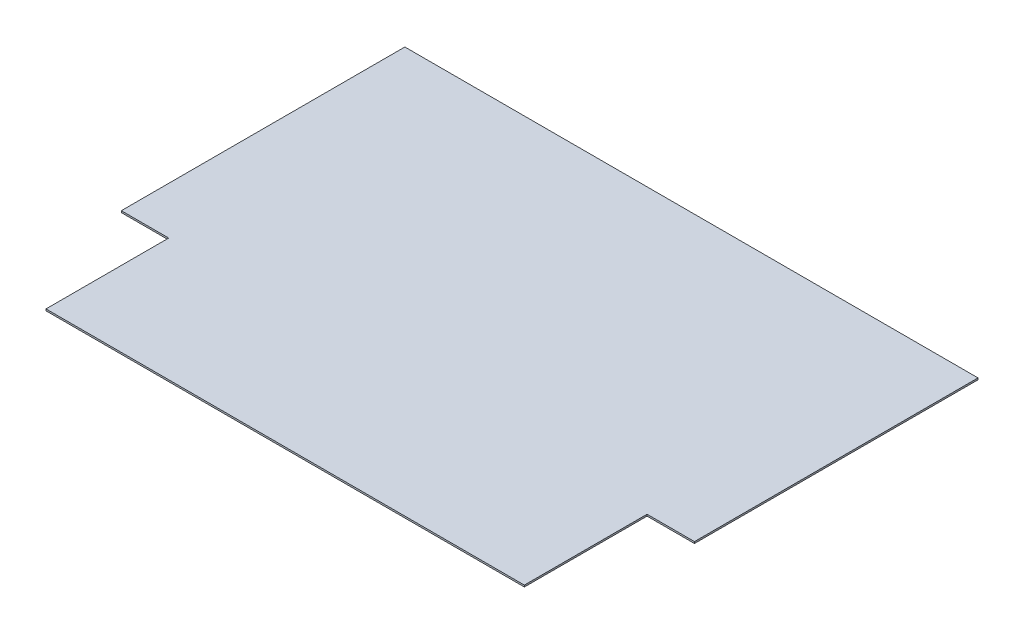
ISO-10303-21;
HEADER;
FILE_DESCRIPTION(('STEP AP214'),'2;1');
FILE_NAME('part.step','',(''),(''),'','','');
FILE_SCHEMA(('AUTOMOTIVE_DESIGN { 1 0 10303 214 1 1 1 1 }'));
ENDSEC;
DATA;
#1=APPLICATION_CONTEXT('core data for automotive mechanical design processes');
#2=APPLICATION_PROTOCOL_DEFINITION('international standard','automotive_design',2000,#1);
#3=PRODUCT_CONTEXT('',#1,'mechanical');
#4=PRODUCT('Part','Part','',(#3));
#5=PRODUCT_RELATED_PRODUCT_CATEGORY('part','',(#4));
#6=PRODUCT_DEFINITION_FORMATION('','',#4);
#7=PRODUCT_DEFINITION_CONTEXT('part definition',#1,'design');
#8=PRODUCT_DEFINITION('design','',#6,#7);
#9=PRODUCT_DEFINITION_SHAPE('','',#8);
#10=(LENGTH_UNIT() NAMED_UNIT(*) SI_UNIT(.MILLI.,.METRE.));
#11=(NAMED_UNIT(*) PLANE_ANGLE_UNIT() SI_UNIT($,.RADIAN.));
#12=(NAMED_UNIT(*) SI_UNIT($,.STERADIAN.) SOLID_ANGLE_UNIT());
#13=UNCERTAINTY_MEASURE_WITH_UNIT(LENGTH_MEASURE(1.E-05),#10,'distance_accuracy_value','');
#14=(GEOMETRIC_REPRESENTATION_CONTEXT(3) GLOBAL_UNCERTAINTY_ASSIGNED_CONTEXT((#13)) GLOBAL_UNIT_ASSIGNED_CONTEXT((#10,
#11,#12)) REPRESENTATION_CONTEXT('',''));
#15=CARTESIAN_POINT('',(0.,0.,0.));
#16=DIRECTION('',(0.,0.,1.));
#17=DIRECTION('',(1.,0.,0.));
#18=AXIS2_PLACEMENT_3D('',#15,#16,#17);
#19=CARTESIAN_POINT('',(-914.400000000001,6.35,0.));
#20=DIRECTION('',(0.,0.,-1.));
#21=DIRECTION('',(-1.,0.,0.));
#22=AXIS2_PLACEMENT_3D('',#19,#20,#21);
#23=PLANE('',#22);
#24=DIRECTION('',(1.,0.,0.));
#25=VECTOR('',#24,1.);
#26=CARTESIAN_POINT('',(-914.400000000001,0.,0.));
#27=LINE('',#26,#25);
#28=CARTESIAN_POINT('',(-1261.09951455284,0.,0.));
#29=VERTEX_POINT('',#28);
#30=CARTESIAN_POINT('',(533.400000000001,0.,0.));
#31=VERTEX_POINT('',#30);
#32=EDGE_CURVE('E113',#29,#31,#27,.T.);
#33=ORIENTED_EDGE('',*,*,#32,.T.);
#34=DIRECTION('',(0.,1.,0.));
#35=VECTOR('',#34,1.);
#36=CARTESIAN_POINT('',(533.400000000001,0.,0.));
#37=LINE('',#36,#35);
#38=CARTESIAN_POINT('',(533.400000000001,6.35,0.));
#39=VERTEX_POINT('',#38);
#40=EDGE_CURVE('E117',#31,#39,#37,.T.);
#41=ORIENTED_EDGE('',*,*,#40,.T.);
#42=DIRECTION('',(1.,0.,0.));
#43=VECTOR('',#42,1.);
#44=CARTESIAN_POINT('',(-914.400000000001,6.35,0.));
#45=LINE('',#44,#43);
#46=CARTESIAN_POINT('',(-1261.09951455284,6.35,0.));
#47=VERTEX_POINT('',#46);
#48=EDGE_CURVE('E42',#47,#39,#45,.T.);
#49=ORIENTED_EDGE('',*,*,#48,.F.);
#50=DIRECTION('',(0.,1.,0.));
#51=VECTOR('',#50,1.);
#52=CARTESIAN_POINT('',(-1261.09951455284,0.,0.));
#53=LINE('',#52,#51);
#54=EDGE_CURVE('E129',#29,#47,#53,.T.);
#55=ORIENTED_EDGE('',*,*,#54,.F.);
#56=EDGE_LOOP('',(#33,#41,#49,#55));
#57=FACE_BOUND('',#56,.T.);
#58=ADVANCED_FACE('F34',(#57),#23,.F.);
#59=CARTESIAN_POINT('',(-1438.89951455284,6.35,0.));
#60=DIRECTION('',(1.,0.,0.));
#61=DIRECTION('',(0.,0.,-1.));
#62=AXIS2_PLACEMENT_3D('',#59,#60,#61);
#63=PLANE('',#62);
#64=DIRECTION('',(0.,0.,1.));
#65=VECTOR('',#64,1.);
#66=CARTESIAN_POINT('',(-1438.89951455284,6.35,0.));
#67=LINE('',#66,#65);
#68=CARTESIAN_POINT('',(-1438.89951455284,6.35,-1524.));
#69=VERTEX_POINT('',#68);
#70=CARTESIAN_POINT('',(-1438.89951455284,6.35,-460.375));
#71=VERTEX_POINT('',#70);
#72=EDGE_CURVE('E11',#69,#71,#67,.T.);
#73=ORIENTED_EDGE('',*,*,#72,.F.);
#74=DIRECTION('',(0.,1.,0.));
#75=VECTOR('',#74,1.);
#76=CARTESIAN_POINT('',(-1438.89951455284,0.,-1524.));
#77=LINE('',#76,#75);
#78=CARTESIAN_POINT('',(-1438.89951455284,0.,-1524.));
#79=VERTEX_POINT('',#78);
#80=EDGE_CURVE('E100',#79,#69,#77,.T.);
#81=ORIENTED_EDGE('',*,*,#80,.F.);
#82=DIRECTION('',(0.,0.,1.));
#83=VECTOR('',#82,1.);
#84=CARTESIAN_POINT('',(-1438.89951455284,0.,0.));
#85=LINE('',#84,#83);
#86=CARTESIAN_POINT('',(-1438.89951455284,0.,-460.375));
#87=VERTEX_POINT('',#86);
#88=EDGE_CURVE('E37',#79,#87,#85,.T.);
#89=ORIENTED_EDGE('',*,*,#88,.T.);
#90=DIRECTION('',(0.,1.,0.));
#91=VECTOR('',#90,1.);
#92=CARTESIAN_POINT('',(-1438.89951455284,0.,-460.375));
#93=LINE('',#92,#91);
#94=EDGE_CURVE('E127',#87,#71,#93,.T.);
#95=ORIENTED_EDGE('',*,*,#94,.T.);
#96=EDGE_LOOP('',(#73,#81,#89,#95));
#97=FACE_BOUND('',#96,.T.);
#98=ADVANCED_FACE('F106',(#97),#63,.F.);
#99=CARTESIAN_POINT('',(0.,6.35,0.));
#100=DIRECTION('',(0.,-1.,0.));
#101=DIRECTION('',(0.,0.,-1.));
#102=AXIS2_PLACEMENT_3D('',#99,#100,#101);
#103=PLANE('',#102);
#104=DIRECTION('',(0.,0.,1.));
#105=VECTOR('',#104,1.);
#106=CARTESIAN_POINT('',(711.200000000001,6.35,-460.375));
#107=LINE('',#106,#105);
#108=CARTESIAN_POINT('',(711.200000000001,6.35,-1524.));
#109=VERTEX_POINT('',#108);
#110=CARTESIAN_POINT('',(711.200000000001,6.35,-460.375));
#111=VERTEX_POINT('',#110);
#112=EDGE_CURVE('E131',#109,#111,#107,.T.);
#113=ORIENTED_EDGE('',*,*,#112,.F.);
#114=DIRECTION('',(1.,0.,0.));
#115=VECTOR('',#114,1.);
#116=CARTESIAN_POINT('',(-1438.89951455284,6.35,-1524.));
#117=LINE('',#116,#115);
#118=EDGE_CURVE('E50',#69,#109,#117,.T.);
#119=ORIENTED_EDGE('',*,*,#118,.F.);
#120=ORIENTED_EDGE('',*,*,#72,.T.);
#121=DIRECTION('',(-1.,0.,0.));
#122=VECTOR('',#121,1.);
#123=CARTESIAN_POINT('',(-1261.09951455284,6.35,-460.375));
#124=LINE('',#123,#122);
#125=CARTESIAN_POINT('',(-1261.09951455284,6.35,-460.375));
#126=VERTEX_POINT('',#125);
#127=EDGE_CURVE('E132',#126,#71,#124,.T.);
#128=ORIENTED_EDGE('',*,*,#127,.F.);
#129=DIRECTION('',(0.,0.,-1.));
#130=VECTOR('',#129,1.);
#131=CARTESIAN_POINT('',(-1261.09951455284,6.35,-460.375));
#132=LINE('',#131,#130);
#133=EDGE_CURVE('E136',#47,#126,#132,.T.);
#134=ORIENTED_EDGE('',*,*,#133,.F.);
#135=ORIENTED_EDGE('',*,*,#48,.T.);
#136=DIRECTION('',(0.,0.,1.));
#137=VECTOR('',#136,1.);
#138=CARTESIAN_POINT('',(533.400000000001,6.35,0.));
#139=LINE('',#138,#137);
#140=CARTESIAN_POINT('',(533.400000000001,6.35,-460.375));
#141=VERTEX_POINT('',#140);
#142=EDGE_CURVE('E146',#141,#39,#139,.T.);
#143=ORIENTED_EDGE('',*,*,#142,.F.);
#144=DIRECTION('',(-1.,0.,0.));
#145=VECTOR('',#144,1.);
#146=CARTESIAN_POINT('',(711.200000000001,6.35,-460.375));
#147=LINE('',#146,#145);
#148=EDGE_CURVE('E149',#111,#141,#147,.T.);
#149=ORIENTED_EDGE('',*,*,#148,.F.);
#150=EDGE_LOOP('',(#113,#119,#120,#128,#134,#135,#143,#149));
#151=FACE_BOUND('',#150,.T.);
#152=ADVANCED_FACE('F166',(#151),#103,.F.);
#153=CARTESIAN_POINT('',(0.,0.,0.));
#154=DIRECTION('',(0.,-1.,0.));
#155=DIRECTION('',(0.,0.,-1.));
#156=AXIS2_PLACEMENT_3D('',#153,#154,#155);
#157=PLANE('',#156);
#158=DIRECTION('',(1.,0.,0.));
#159=VECTOR('',#158,1.);
#160=CARTESIAN_POINT('',(-1438.89951455284,0.,-1524.));
#161=LINE('',#160,#159);
#162=CARTESIAN_POINT('',(711.2,0.,-1524.));
#163=VERTEX_POINT('',#162);
#164=EDGE_CURVE('E98',#79,#163,#161,.T.);
#165=ORIENTED_EDGE('',*,*,#164,.T.);
#166=DIRECTION('',(0.,0.,1.));
#167=VECTOR('',#166,1.);
#168=CARTESIAN_POINT('',(711.200000000001,0.,-460.375));
#169=LINE('',#168,#167);
#170=CARTESIAN_POINT('',(711.200000000001,0.,-460.375));
#171=VERTEX_POINT('',#170);
#172=EDGE_CURVE('E148',#163,#171,#169,.T.);
#173=ORIENTED_EDGE('',*,*,#172,.T.);
#174=DIRECTION('',(-1.,0.,0.));
#175=VECTOR('',#174,1.);
#176=CARTESIAN_POINT('',(711.200000000001,0.,-460.375));
#177=LINE('',#176,#175);
#178=CARTESIAN_POINT('',(533.400000000001,0.,-460.375));
#179=VERTEX_POINT('',#178);
#180=EDGE_CURVE('E155',#171,#179,#177,.T.);
#181=ORIENTED_EDGE('',*,*,#180,.T.);
#182=DIRECTION('',(0.,0.,1.));
#183=VECTOR('',#182,1.);
#184=CARTESIAN_POINT('',(533.400000000001,0.,0.));
#185=LINE('',#184,#183);
#186=EDGE_CURVE('E144',#179,#31,#185,.T.);
#187=ORIENTED_EDGE('',*,*,#186,.T.);
#188=ORIENTED_EDGE('',*,*,#32,.F.);
#189=DIRECTION('',(0.,0.,-1.));
#190=VECTOR('',#189,1.);
#191=CARTESIAN_POINT('',(-1261.09951455284,0.,-460.375));
#192=LINE('',#191,#190);
#193=CARTESIAN_POINT('',(-1261.09951455284,0.,-460.375));
#194=VERTEX_POINT('',#193);
#195=EDGE_CURVE('E135',#29,#194,#192,.T.);
#196=ORIENTED_EDGE('',*,*,#195,.T.);
#197=DIRECTION('',(-1.,0.,0.));
#198=VECTOR('',#197,1.);
#199=CARTESIAN_POINT('',(-1261.09951455284,0.,-460.375));
#200=LINE('',#199,#198);
#201=EDGE_CURVE('E112',#194,#87,#200,.T.);
#202=ORIENTED_EDGE('',*,*,#201,.T.);
#203=ORIENTED_EDGE('',*,*,#88,.F.);
#204=EDGE_LOOP('',(#165,#173,#181,#187,#188,#196,#202,#203));
#205=FACE_BOUND('',#204,.T.);
#206=ADVANCED_FACE('F109',(#205),#157,.T.);
#207=CARTESIAN_POINT('',(-1261.09951455284,0.,-460.375));
#208=DIRECTION('',(1.,0.,0.));
#209=DIRECTION('',(0.,0.,-1.));
#210=AXIS2_PLACEMENT_3D('',#207,#208,#209);
#211=PLANE('',#210);
#212=ORIENTED_EDGE('',*,*,#133,.T.);
#213=DIRECTION('',(0.,1.,0.));
#214=VECTOR('',#213,1.);
#215=CARTESIAN_POINT('',(-1261.09951455284,0.,-460.375));
#216=LINE('',#215,#214);
#217=EDGE_CURVE('E125',#194,#126,#216,.T.);
#218=ORIENTED_EDGE('',*,*,#217,.F.);
#219=ORIENTED_EDGE('',*,*,#195,.F.);
#220=ORIENTED_EDGE('',*,*,#54,.T.);
#221=EDGE_LOOP('',(#212,#218,#219,#220));
#222=FACE_BOUND('',#221,.T.);
#223=ADVANCED_FACE('F178',(#222),#211,.F.);
#224=CARTESIAN_POINT('',(-1261.09951455284,0.,-460.375));
#225=DIRECTION('',(0.,0.,-1.));
#226=DIRECTION('',(-1.,0.,0.));
#227=AXIS2_PLACEMENT_3D('',#224,#225,#226);
#228=PLANE('',#227);
#229=ORIENTED_EDGE('',*,*,#127,.T.);
#230=ORIENTED_EDGE('',*,*,#94,.F.);
#231=ORIENTED_EDGE('',*,*,#201,.F.);
#232=ORIENTED_EDGE('',*,*,#217,.T.);
#233=EDGE_LOOP('',(#229,#230,#231,#232));
#234=FACE_BOUND('',#233,.T.);
#235=ADVANCED_FACE('F180',(#234),#228,.F.);
#236=CARTESIAN_POINT('',(533.400000000001,0.,0.));
#237=DIRECTION('',(-1.,0.,0.));
#238=DIRECTION('',(0.,0.,1.));
#239=AXIS2_PLACEMENT_3D('',#236,#237,#238);
#240=PLANE('',#239);
#241=ORIENTED_EDGE('',*,*,#142,.T.);
#242=ORIENTED_EDGE('',*,*,#40,.F.);
#243=ORIENTED_EDGE('',*,*,#186,.F.);
#244=DIRECTION('',(0.,1.,0.));
#245=VECTOR('',#244,1.);
#246=CARTESIAN_POINT('',(533.400000000001,0.,-460.375));
#247=LINE('',#246,#245);
#248=EDGE_CURVE('E122',#179,#141,#247,.T.);
#249=ORIENTED_EDGE('',*,*,#248,.T.);
#250=EDGE_LOOP('',(#241,#242,#243,#249));
#251=FACE_BOUND('',#250,.T.);
#252=ADVANCED_FACE('F173',(#251),#240,.F.);
#253=CARTESIAN_POINT('',(711.200000000001,0.,-460.375));
#254=DIRECTION('',(0.,0.,-1.));
#255=DIRECTION('',(-1.,0.,0.));
#256=AXIS2_PLACEMENT_3D('',#253,#254,#255);
#257=PLANE('',#256);
#258=ORIENTED_EDGE('',*,*,#148,.T.);
#259=ORIENTED_EDGE('',*,*,#248,.F.);
#260=ORIENTED_EDGE('',*,*,#180,.F.);
#261=DIRECTION('',(0.,1.,0.));
#262=VECTOR('',#261,1.);
#263=CARTESIAN_POINT('',(711.200000000001,0.,-460.375));
#264=LINE('',#263,#262);
#265=EDGE_CURVE('E141',#171,#111,#264,.T.);
#266=ORIENTED_EDGE('',*,*,#265,.T.);
#267=EDGE_LOOP('',(#258,#259,#260,#266));
#268=FACE_BOUND('',#267,.T.);
#269=ADVANCED_FACE('F169',(#268),#257,.F.);
#270=CARTESIAN_POINT('',(711.200000000001,0.,-460.375));
#271=DIRECTION('',(-1.,0.,0.));
#272=DIRECTION('',(0.,0.,1.));
#273=AXIS2_PLACEMENT_3D('',#270,#271,#272);
#274=PLANE('',#273);
#275=ORIENTED_EDGE('',*,*,#172,.F.);
#276=DIRECTION('',(0.,1.,0.));
#277=VECTOR('',#276,1.);
#278=CARTESIAN_POINT('',(711.2,0.,-1524.));
#279=LINE('',#278,#277);
#280=EDGE_CURVE('E101',#163,#109,#279,.T.);
#281=ORIENTED_EDGE('',*,*,#280,.T.);
#282=ORIENTED_EDGE('',*,*,#112,.T.);
#283=ORIENTED_EDGE('',*,*,#265,.F.);
#284=EDGE_LOOP('',(#275,#281,#282,#283));
#285=FACE_BOUND('',#284,.T.);
#286=ADVANCED_FACE('F162',(#285),#274,.F.);
#287=CARTESIAN_POINT('',(-1438.89951455284,0.,-1524.));
#288=DIRECTION('',(0.,0.,1.));
#289=DIRECTION('',(1.,0.,0.));
#290=AXIS2_PLACEMENT_3D('',#287,#288,#289);
#291=PLANE('',#290);
#292=ORIENTED_EDGE('',*,*,#118,.T.);
#293=ORIENTED_EDGE('',*,*,#280,.F.);
#294=ORIENTED_EDGE('',*,*,#164,.F.);
#295=ORIENTED_EDGE('',*,*,#80,.T.);
#296=EDGE_LOOP('',(#292,#293,#294,#295));
#297=FACE_BOUND('',#296,.T.);
#298=ADVANCED_FACE('F99',(#297),#291,.F.);
#299=CLOSED_SHELL('',(#58,#98,#152,#206,#223,#235,#252,#269,#286,#298));
#300=MANIFOLD_SOLID_BREP('B2',#299);
#301=ADVANCED_BREP_SHAPE_REPRESENTATION('',(#18,#300),#14);
#302=SHAPE_DEFINITION_REPRESENTATION(#9,#301);
ENDSEC;
END-ISO-10303-21;
